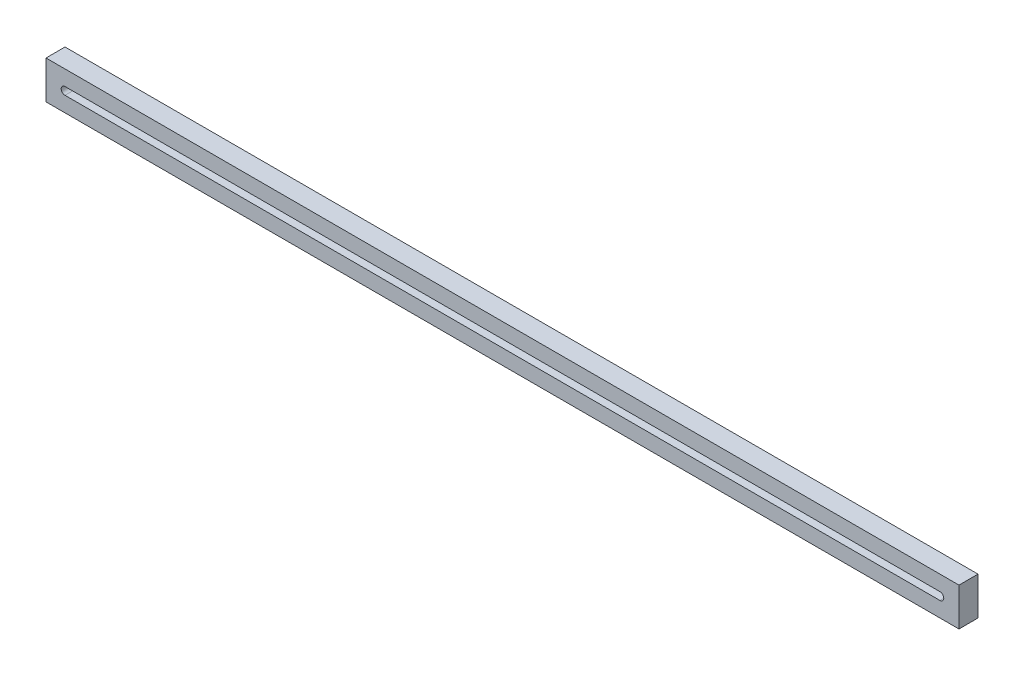
ISO-10303-21;
HEADER;
FILE_DESCRIPTION(('STEP AP214'),'2;1');
FILE_NAME('part.step','',(''),(''),'','','');
FILE_SCHEMA(('AUTOMOTIVE_DESIGN { 1 0 10303 214 1 1 1 1 }'));
ENDSEC;
DATA;
#1=APPLICATION_CONTEXT('core data for automotive mechanical design processes');
#2=APPLICATION_PROTOCOL_DEFINITION('international standard','automotive_design',2000,#1);
#3=PRODUCT_CONTEXT('',#1,'mechanical');
#4=PRODUCT('Part','Part','',(#3));
#5=PRODUCT_RELATED_PRODUCT_CATEGORY('part','',(#4));
#6=PRODUCT_DEFINITION_FORMATION('','',#4);
#7=PRODUCT_DEFINITION_CONTEXT('part definition',#1,'design');
#8=PRODUCT_DEFINITION('design','',#6,#7);
#9=PRODUCT_DEFINITION_SHAPE('','',#8);
#10=(LENGTH_UNIT() NAMED_UNIT(*) SI_UNIT(.MILLI.,.METRE.));
#11=(NAMED_UNIT(*) PLANE_ANGLE_UNIT() SI_UNIT($,.RADIAN.));
#12=(NAMED_UNIT(*) SI_UNIT($,.STERADIAN.) SOLID_ANGLE_UNIT());
#13=UNCERTAINTY_MEASURE_WITH_UNIT(LENGTH_MEASURE(1.E-05),#10,'distance_accuracy_value','');
#14=(GEOMETRIC_REPRESENTATION_CONTEXT(3) GLOBAL_UNCERTAINTY_ASSIGNED_CONTEXT((#13)) GLOBAL_UNIT_ASSIGNED_CONTEXT((#10,
#11,#12)) REPRESENTATION_CONTEXT('',''));
#15=CARTESIAN_POINT('',(0.,0.,0.));
#16=DIRECTION('',(0.,0.,1.));
#17=DIRECTION('',(1.,0.,0.));
#18=AXIS2_PLACEMENT_3D('',#15,#16,#17);
#19=CARTESIAN_POINT('',(152.4,3.33066907387547E-13,6.35));
#20=DIRECTION('',(1.,0.,0.));
#21=DIRECTION('',(0.,1.,0.));
#22=AXIS2_PLACEMENT_3D('',#19,#20,#21);
#23=PLANE('',#22);
#24=DIRECTION('',(0.,-1.,0.));
#25=VECTOR('',#24,1.);
#26=CARTESIAN_POINT('',(152.4,3.33066907387547E-13,0.));
#27=LINE('',#26,#25);
#28=CARTESIAN_POINT('',(152.4,6.34999999999999,0.));
#29=VERTEX_POINT('',#28);
#30=CARTESIAN_POINT('',(152.4,-6.35,0.));
#31=VERTEX_POINT('',#30);
#32=EDGE_CURVE('E163',#29,#31,#27,.T.);
#33=ORIENTED_EDGE('',*,*,#32,.F.);
#34=DIRECTION('',(0.,0.,-1.));
#35=VECTOR('',#34,1.);
#36=CARTESIAN_POINT('',(152.4,6.34999999999999,6.35));
#37=LINE('',#36,#35);
#38=CARTESIAN_POINT('',(152.4,6.34999999999999,6.35));
#39=VERTEX_POINT('',#38);
#40=EDGE_CURVE('E11',#39,#29,#37,.T.);
#41=ORIENTED_EDGE('',*,*,#40,.F.);
#42=DIRECTION('',(0.,-1.,0.));
#43=VECTOR('',#42,1.);
#44=CARTESIAN_POINT('',(152.4,3.33066907387547E-13,6.35));
#45=LINE('',#44,#43);
#46=CARTESIAN_POINT('',(152.4,-6.35,6.35));
#47=VERTEX_POINT('',#46);
#48=EDGE_CURVE('E136',#39,#47,#45,.T.);
#49=ORIENTED_EDGE('',*,*,#48,.T.);
#50=DIRECTION('',(0.,0.,-1.));
#51=VECTOR('',#50,1.);
#52=CARTESIAN_POINT('',(152.4,-6.35,6.35));
#53=LINE('',#52,#51);
#54=EDGE_CURVE('E96',#47,#31,#53,.T.);
#55=ORIENTED_EDGE('',*,*,#54,.T.);
#56=EDGE_LOOP('',(#33,#41,#49,#55));
#57=FACE_BOUND('',#56,.T.);
#58=ADVANCED_FACE('F41',(#57),#23,.T.);
#59=CARTESIAN_POINT('',(0.,6.34999999999999,6.35));
#60=DIRECTION('',(0.,1.,0.));
#61=DIRECTION('',(0.,0.,1.));
#62=AXIS2_PLACEMENT_3D('',#59,#60,#61);
#63=PLANE('',#62);
#64=DIRECTION('',(1.,0.,0.));
#65=VECTOR('',#64,1.);
#66=CARTESIAN_POINT('',(0.,6.34999999999999,0.));
#67=LINE('',#66,#65);
#68=CARTESIAN_POINT('',(-152.4,6.34999999999999,0.));
#69=VERTEX_POINT('',#68);
#70=EDGE_CURVE('E124',#69,#29,#67,.T.);
#71=ORIENTED_EDGE('',*,*,#70,.F.);
#72=DIRECTION('',(0.,0.,-1.));
#73=VECTOR('',#72,1.);
#74=CARTESIAN_POINT('',(-152.4,6.34999999999999,6.35));
#75=LINE('',#74,#73);
#76=CARTESIAN_POINT('',(-152.4,6.34999999999999,6.35));
#77=VERTEX_POINT('',#76);
#78=EDGE_CURVE('E52',#77,#69,#75,.T.);
#79=ORIENTED_EDGE('',*,*,#78,.F.);
#80=DIRECTION('',(1.,0.,0.));
#81=VECTOR('',#80,1.);
#82=CARTESIAN_POINT('',(0.,6.34999999999999,6.35));
#83=LINE('',#82,#81);
#84=EDGE_CURVE('E122',#77,#39,#83,.T.);
#85=ORIENTED_EDGE('',*,*,#84,.T.);
#86=ORIENTED_EDGE('',*,*,#40,.T.);
#87=EDGE_LOOP('',(#71,#79,#85,#86));
#88=FACE_BOUND('',#87,.T.);
#89=ADVANCED_FACE('F120',(#88),#63,.T.);
#90=CARTESIAN_POINT('',(-152.4,0.,6.35));
#91=DIRECTION('',(1.,0.,0.));
#92=DIRECTION('',(0.,0.,-1.));
#93=AXIS2_PLACEMENT_3D('',#90,#91,#92);
#94=PLANE('',#93);
#95=DIRECTION('',(0.,-1.,0.));
#96=VECTOR('',#95,1.);
#97=CARTESIAN_POINT('',(-152.4,0.,0.));
#98=LINE('',#97,#96);
#99=CARTESIAN_POINT('',(-152.4,-6.35000000000002,0.));
#100=VERTEX_POINT('',#99);
#101=EDGE_CURVE('E168',#69,#100,#98,.T.);
#102=ORIENTED_EDGE('',*,*,#101,.T.);
#103=DIRECTION('',(0.,0.,-1.));
#104=VECTOR('',#103,1.);
#105=CARTESIAN_POINT('',(-152.4,-6.35000000000002,6.35));
#106=LINE('',#105,#104);
#107=CARTESIAN_POINT('',(-152.4,-6.35000000000002,6.35));
#108=VERTEX_POINT('',#107);
#109=EDGE_CURVE('E128',#108,#100,#106,.T.);
#110=ORIENTED_EDGE('',*,*,#109,.F.);
#111=DIRECTION('',(0.,-1.,0.));
#112=VECTOR('',#111,1.);
#113=CARTESIAN_POINT('',(-152.4,0.,6.35));
#114=LINE('',#113,#112);
#115=EDGE_CURVE('E131',#77,#108,#114,.T.);
#116=ORIENTED_EDGE('',*,*,#115,.F.);
#117=ORIENTED_EDGE('',*,*,#78,.T.);
#118=EDGE_LOOP('',(#102,#110,#116,#117));
#119=FACE_BOUND('',#118,.T.);
#120=ADVANCED_FACE('F132',(#119),#94,.F.);
#121=CARTESIAN_POINT('',(146.05,0.,6.35));
#122=DIRECTION('',(0.,0.,-1.));
#123=DIRECTION('',(-1.,0.,0.));
#124=AXIS2_PLACEMENT_3D('',#121,#122,#123);
#125=CYLINDRICAL_SURFACE('',#124,1.27);
#126=CARTESIAN_POINT('',(146.05,0.,0.));
#127=DIRECTION('',(0.,0.,1.));
#128=DIRECTION('',(1.,0.,0.));
#129=AXIS2_PLACEMENT_3D('',#126,#127,#128);
#130=CIRCLE('',#129,1.27);
#131=CARTESIAN_POINT('',(146.05,-1.27,0.));
#132=VERTEX_POINT('',#131);
#133=CARTESIAN_POINT('',(146.05,1.27,0.));
#134=VERTEX_POINT('',#133);
#135=EDGE_CURVE('E147',#132,#134,#130,.T.);
#136=ORIENTED_EDGE('',*,*,#135,.F.);
#137=DIRECTION('',(0.,0.,-1.));
#138=VECTOR('',#137,1.);
#139=CARTESIAN_POINT('',(146.05,-1.27,6.35));
#140=LINE('',#139,#138);
#141=CARTESIAN_POINT('',(146.05,-1.27,6.35));
#142=VERTEX_POINT('',#141);
#143=EDGE_CURVE('E45',#142,#132,#140,.T.);
#144=ORIENTED_EDGE('',*,*,#143,.F.);
#145=CARTESIAN_POINT('',(146.05,0.,6.35));
#146=DIRECTION('',(0.,0.,1.));
#147=DIRECTION('',(1.,0.,0.));
#148=AXIS2_PLACEMENT_3D('',#145,#146,#147);
#149=CIRCLE('',#148,1.27);
#150=CARTESIAN_POINT('',(146.05,1.27,6.35));
#151=VERTEX_POINT('',#150);
#152=EDGE_CURVE('E173',#142,#151,#149,.T.);
#153=ORIENTED_EDGE('',*,*,#152,.T.);
#154=DIRECTION('',(0.,0.,-1.));
#155=VECTOR('',#154,1.);
#156=CARTESIAN_POINT('',(146.05,1.27,6.35));
#157=LINE('',#156,#155);
#158=EDGE_CURVE('E146',#151,#134,#157,.T.);
#159=ORIENTED_EDGE('',*,*,#158,.T.);
#160=EDGE_LOOP('',(#136,#144,#153,#159));
#161=FACE_BOUND('',#160,.T.);
#162=ADVANCED_FACE('F43',(#161),#125,.F.);
#163=CARTESIAN_POINT('',(0.,-1.27,6.35));
#164=DIRECTION('',(0.,1.,0.));
#165=DIRECTION('',(0.,0.,1.));
#166=AXIS2_PLACEMENT_3D('',#163,#164,#165);
#167=PLANE('',#166);
#168=DIRECTION('',(1.,0.,0.));
#169=VECTOR('',#168,1.);
#170=CARTESIAN_POINT('',(0.,-1.27,0.));
#171=LINE('',#170,#169);
#172=CARTESIAN_POINT('',(-146.05,-1.27,0.));
#173=VERTEX_POINT('',#172);
#174=EDGE_CURVE('E151',#173,#132,#171,.T.);
#175=ORIENTED_EDGE('',*,*,#174,.F.);
#176=DIRECTION('',(0.,0.,-1.));
#177=VECTOR('',#176,1.);
#178=CARTESIAN_POINT('',(-146.05,-1.27,6.35));
#179=LINE('',#178,#177);
#180=CARTESIAN_POINT('',(-146.05,-1.27,6.35));
#181=VERTEX_POINT('',#180);
#182=EDGE_CURVE('E182',#181,#173,#179,.T.);
#183=ORIENTED_EDGE('',*,*,#182,.F.);
#184=DIRECTION('',(1.,0.,0.));
#185=VECTOR('',#184,1.);
#186=CARTESIAN_POINT('',(0.,-1.27,6.35));
#187=LINE('',#186,#185);
#188=EDGE_CURVE('E193',#181,#142,#187,.T.);
#189=ORIENTED_EDGE('',*,*,#188,.T.);
#190=ORIENTED_EDGE('',*,*,#143,.T.);
#191=EDGE_LOOP('',(#175,#183,#189,#190));
#192=FACE_BOUND('',#191,.T.);
#193=ADVANCED_FACE('F191',(#192),#167,.T.);
#194=CARTESIAN_POINT('',(-146.05,0.,6.35));
#195=DIRECTION('',(0.,0.,-1.));
#196=DIRECTION('',(-1.,0.,0.));
#197=AXIS2_PLACEMENT_3D('',#194,#195,#196);
#198=CYLINDRICAL_SURFACE('',#197,1.27);
#199=CARTESIAN_POINT('',(-146.05,0.,0.));
#200=DIRECTION('',(0.,0.,1.));
#201=DIRECTION('',(1.,0.,0.));
#202=AXIS2_PLACEMENT_3D('',#199,#200,#201);
#203=CIRCLE('',#202,1.27);
#204=CARTESIAN_POINT('',(-146.05,1.27,0.));
#205=VERTEX_POINT('',#204);
#206=EDGE_CURVE('E155',#205,#173,#203,.T.);
#207=ORIENTED_EDGE('',*,*,#206,.F.);
#208=DIRECTION('',(0.,0.,-1.));
#209=VECTOR('',#208,1.);
#210=CARTESIAN_POINT('',(-146.05,1.27,6.35));
#211=LINE('',#210,#209);
#212=CARTESIAN_POINT('',(-146.05,1.27,6.35));
#213=VERTEX_POINT('',#212);
#214=EDGE_CURVE('E180',#213,#205,#211,.T.);
#215=ORIENTED_EDGE('',*,*,#214,.F.);
#216=CARTESIAN_POINT('',(-146.05,0.,6.35));
#217=DIRECTION('',(0.,0.,1.));
#218=DIRECTION('',(1.,0.,0.));
#219=AXIS2_PLACEMENT_3D('',#216,#217,#218);
#220=CIRCLE('',#219,1.27);
#221=EDGE_CURVE('E201',#213,#181,#220,.T.);
#222=ORIENTED_EDGE('',*,*,#221,.T.);
#223=ORIENTED_EDGE('',*,*,#182,.T.);
#224=EDGE_LOOP('',(#207,#215,#222,#223));
#225=FACE_BOUND('',#224,.T.);
#226=ADVANCED_FACE('F198',(#225),#198,.F.);
#227=CARTESIAN_POINT('',(0.,1.27,6.35));
#228=DIRECTION('',(0.,1.,0.));
#229=DIRECTION('',(0.,0.,1.));
#230=AXIS2_PLACEMENT_3D('',#227,#228,#229);
#231=PLANE('',#230);
#232=DIRECTION('',(1.,0.,0.));
#233=VECTOR('',#232,1.);
#234=CARTESIAN_POINT('',(0.,1.27,0.));
#235=LINE('',#234,#233);
#236=EDGE_CURVE('E159',#205,#134,#235,.T.);
#237=ORIENTED_EDGE('',*,*,#236,.T.);
#238=ORIENTED_EDGE('',*,*,#158,.F.);
#239=DIRECTION('',(1.,0.,0.));
#240=VECTOR('',#239,1.);
#241=CARTESIAN_POINT('',(0.,1.27,6.35));
#242=LINE('',#241,#240);
#243=EDGE_CURVE('E140',#213,#151,#242,.T.);
#244=ORIENTED_EDGE('',*,*,#243,.F.);
#245=ORIENTED_EDGE('',*,*,#214,.T.);
#246=EDGE_LOOP('',(#237,#238,#244,#245));
#247=FACE_BOUND('',#246,.T.);
#248=ADVANCED_FACE('F203',(#247),#231,.F.);
#249=CARTESIAN_POINT('',(0.,-6.35000000000001,6.35));
#250=DIRECTION('',(0.,1.,0.));
#251=DIRECTION('',(-1.,0.,0.));
#252=AXIS2_PLACEMENT_3D('',#249,#250,#251);
#253=PLANE('',#252);
#254=DIRECTION('',(1.,0.,0.));
#255=VECTOR('',#254,1.);
#256=CARTESIAN_POINT('',(0.,-6.35000000000001,0.));
#257=LINE('',#256,#255);
#258=EDGE_CURVE('E89',#100,#31,#257,.T.);
#259=ORIENTED_EDGE('',*,*,#258,.T.);
#260=ORIENTED_EDGE('',*,*,#54,.F.);
#261=DIRECTION('',(1.,0.,0.));
#262=VECTOR('',#261,1.);
#263=CARTESIAN_POINT('',(0.,-6.35000000000001,6.35));
#264=LINE('',#263,#262);
#265=EDGE_CURVE('E61',#108,#47,#264,.T.);
#266=ORIENTED_EDGE('',*,*,#265,.F.);
#267=ORIENTED_EDGE('',*,*,#109,.T.);
#268=EDGE_LOOP('',(#259,#260,#266,#267));
#269=FACE_BOUND('',#268,.T.);
#270=ADVANCED_FACE('F213',(#269),#253,.F.);
#271=CARTESIAN_POINT('',(0.,0.,6.35));
#272=DIRECTION('',(0.,0.,1.));
#273=DIRECTION('',(1.,0.,0.));
#274=AXIS2_PLACEMENT_3D('',#271,#272,#273);
#275=PLANE('',#274);
#276=ORIENTED_EDGE('',*,*,#152,.F.);
#277=ORIENTED_EDGE('',*,*,#188,.F.);
#278=ORIENTED_EDGE('',*,*,#221,.F.);
#279=ORIENTED_EDGE('',*,*,#243,.T.);
#280=EDGE_LOOP('',(#276,#277,#278,#279));
#281=FACE_BOUND('',#280,.T.);
#282=ORIENTED_EDGE('',*,*,#48,.F.);
#283=ORIENTED_EDGE('',*,*,#84,.F.);
#284=ORIENTED_EDGE('',*,*,#115,.T.);
#285=ORIENTED_EDGE('',*,*,#265,.T.);
#286=EDGE_LOOP('',(#282,#283,#284,#285));
#287=FACE_BOUND('',#286,.T.);
#288=ADVANCED_FACE('F135',(#281,#287),#275,.T.);
#289=CARTESIAN_POINT('',(0.,0.,0.));
#290=DIRECTION('',(0.,0.,1.));
#291=DIRECTION('',(1.,0.,0.));
#292=AXIS2_PLACEMENT_3D('',#289,#290,#291);
#293=PLANE('',#292);
#294=ORIENTED_EDGE('',*,*,#135,.T.);
#295=ORIENTED_EDGE('',*,*,#236,.F.);
#296=ORIENTED_EDGE('',*,*,#206,.T.);
#297=ORIENTED_EDGE('',*,*,#174,.T.);
#298=EDGE_LOOP('',(#294,#295,#296,#297));
#299=FACE_BOUND('',#298,.T.);
#300=ORIENTED_EDGE('',*,*,#32,.T.);
#301=ORIENTED_EDGE('',*,*,#258,.F.);
#302=ORIENTED_EDGE('',*,*,#101,.F.);
#303=ORIENTED_EDGE('',*,*,#70,.T.);
#304=EDGE_LOOP('',(#300,#301,#302,#303));
#305=FACE_BOUND('',#304,.T.);
#306=ADVANCED_FACE('F197',(#299,#305),#293,.F.);
#307=CLOSED_SHELL('',(#58,#89,#120,#162,#193,#226,#248,#270,#288,#306));
#308=MANIFOLD_SOLID_BREP('B2',#307);
#309=ADVANCED_BREP_SHAPE_REPRESENTATION('',(#18,#308),#14);
#310=SHAPE_DEFINITION_REPRESENTATION(#9,#309);
ENDSEC;
END-ISO-10303-21;
